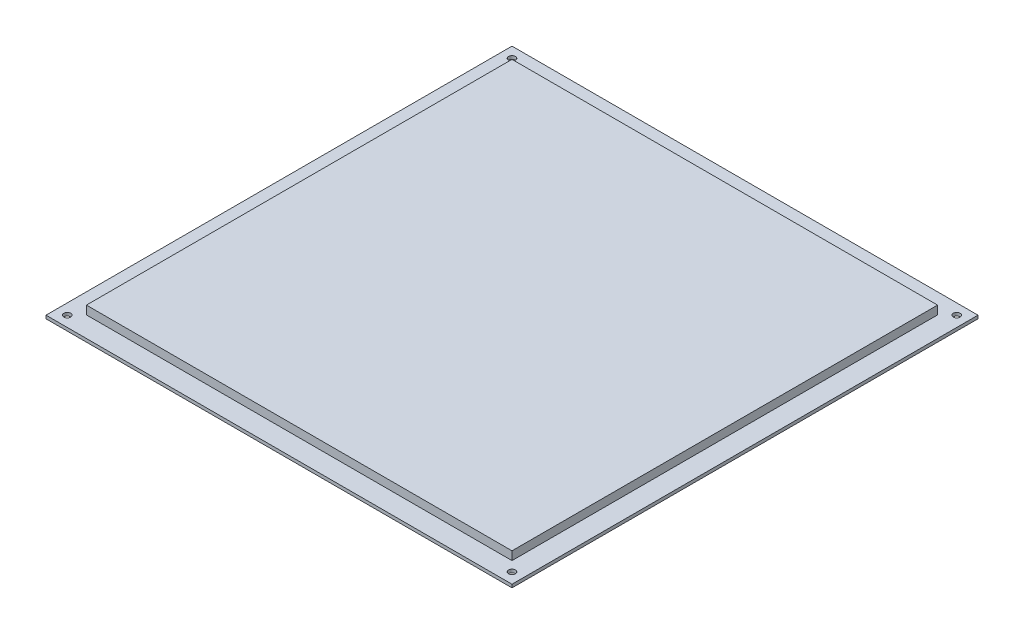
ISO-10303-21;
HEADER;
FILE_DESCRIPTION(('STEP AP214'),'2;1');
FILE_NAME('part.step','',(''),(''),'','','');
FILE_SCHEMA(('AUTOMOTIVE_DESIGN { 1 0 10303 214 1 1 1 1 }'));
ENDSEC;
DATA;
#1=APPLICATION_CONTEXT('core data for automotive mechanical design processes');
#2=APPLICATION_PROTOCOL_DEFINITION('international standard','automotive_design',2000,#1);
#3=PRODUCT_CONTEXT('',#1,'mechanical');
#4=PRODUCT('Part','Part','',(#3));
#5=PRODUCT_RELATED_PRODUCT_CATEGORY('part','',(#4));
#6=PRODUCT_DEFINITION_FORMATION('','',#4);
#7=PRODUCT_DEFINITION_CONTEXT('part definition',#1,'design');
#8=PRODUCT_DEFINITION('design','',#6,#7);
#9=PRODUCT_DEFINITION_SHAPE('','',#8);
#10=(LENGTH_UNIT() NAMED_UNIT(*) SI_UNIT(.MILLI.,.METRE.));
#11=(NAMED_UNIT(*) PLANE_ANGLE_UNIT() SI_UNIT($,.RADIAN.));
#12=(NAMED_UNIT(*) SI_UNIT($,.STERADIAN.) SOLID_ANGLE_UNIT());
#13=UNCERTAINTY_MEASURE_WITH_UNIT(LENGTH_MEASURE(1.E-05),#10,'distance_accuracy_value','');
#14=(GEOMETRIC_REPRESENTATION_CONTEXT(3) GLOBAL_UNCERTAINTY_ASSIGNED_CONTEXT((#13)) GLOBAL_UNIT_ASSIGNED_CONTEXT((#10,
#11,#12)) REPRESENTATION_CONTEXT('',''));
#15=CARTESIAN_POINT('',(0.,0.,0.));
#16=DIRECTION('',(0.,0.,1.));
#17=DIRECTION('',(1.,0.,0.));
#18=AXIS2_PLACEMENT_3D('',#15,#16,#17);
#19=CARTESIAN_POINT('',(100.,5.6,-100.));
#20=DIRECTION('',(-1.,0.,0.));
#21=DIRECTION('',(0.,0.,1.));
#22=AXIS2_PLACEMENT_3D('',#19,#20,#21);
#23=PLANE('',#22);
#24=DIRECTION('',(0.,0.,-1.));
#25=VECTOR('',#24,1.);
#26=CARTESIAN_POINT('',(100.,1.6,-100.));
#27=LINE('',#26,#25);
#28=CARTESIAN_POINT('',(100.,1.6,100.));
#29=VERTEX_POINT('',#28);
#30=CARTESIAN_POINT('',(100.,1.6,-100.));
#31=VERTEX_POINT('',#30);
#32=EDGE_CURVE('E108',#29,#31,#27,.T.);
#33=ORIENTED_EDGE('',*,*,#32,.T.);
#34=DIRECTION('',(0.,-1.,0.));
#35=VECTOR('',#34,1.);
#36=CARTESIAN_POINT('',(100.,5.6,-100.));
#37=LINE('',#36,#35);
#38=CARTESIAN_POINT('',(100.,5.6,-100.));
#39=VERTEX_POINT('',#38);
#40=EDGE_CURVE('E12',#39,#31,#37,.T.);
#41=ORIENTED_EDGE('',*,*,#40,.F.);
#42=DIRECTION('',(0.,0.,-1.));
#43=VECTOR('',#42,1.);
#44=CARTESIAN_POINT('',(100.,5.6,-100.));
#45=LINE('',#44,#43);
#46=CARTESIAN_POINT('',(100.,5.6,100.));
#47=VERTEX_POINT('',#46);
#48=EDGE_CURVE('E96',#47,#39,#45,.T.);
#49=ORIENTED_EDGE('',*,*,#48,.F.);
#50=DIRECTION('',(0.,-1.,0.));
#51=VECTOR('',#50,1.);
#52=CARTESIAN_POINT('',(100.,5.6,100.));
#53=LINE('',#52,#51);
#54=EDGE_CURVE('E104',#47,#29,#53,.T.);
#55=ORIENTED_EDGE('',*,*,#54,.T.);
#56=EDGE_LOOP('',(#33,#41,#49,#55));
#57=FACE_BOUND('',#56,.T.);
#58=ADVANCED_FACE('F45',(#57),#23,.F.);
#59=CARTESIAN_POINT('',(-100.,5.6,-100.));
#60=DIRECTION('',(0.,0.,1.));
#61=DIRECTION('',(1.,0.,0.));
#62=AXIS2_PLACEMENT_3D('',#59,#60,#61);
#63=PLANE('',#62);
#64=DIRECTION('',(-1.,0.,0.));
#65=VECTOR('',#64,1.);
#66=CARTESIAN_POINT('',(-100.,1.6,-100.));
#67=LINE('',#66,#65);
#68=CARTESIAN_POINT('',(-100.,1.6,-100.));
#69=VERTEX_POINT('',#68);
#70=EDGE_CURVE('E100',#31,#69,#67,.T.);
#71=ORIENTED_EDGE('',*,*,#70,.T.);
#72=DIRECTION('',(0.,-1.,0.));
#73=VECTOR('',#72,1.);
#74=CARTESIAN_POINT('',(-100.,5.6,-100.));
#75=LINE('',#74,#73);
#76=CARTESIAN_POINT('',(-100.,5.6,-100.));
#77=VERTEX_POINT('',#76);
#78=EDGE_CURVE('E53',#77,#69,#75,.T.);
#79=ORIENTED_EDGE('',*,*,#78,.F.);
#80=DIRECTION('',(-1.,0.,0.));
#81=VECTOR('',#80,1.);
#82=CARTESIAN_POINT('',(-100.,5.6,-100.));
#83=LINE('',#82,#81);
#84=EDGE_CURVE('E91',#39,#77,#83,.T.);
#85=ORIENTED_EDGE('',*,*,#84,.F.);
#86=ORIENTED_EDGE('',*,*,#40,.T.);
#87=EDGE_LOOP('',(#71,#79,#85,#86));
#88=FACE_BOUND('',#87,.T.);
#89=ADVANCED_FACE('F99',(#88),#63,.F.);
#90=CARTESIAN_POINT('',(-100.,5.6,-100.));
#91=DIRECTION('',(1.,0.,0.));
#92=DIRECTION('',(0.,0.,-1.));
#93=AXIS2_PLACEMENT_3D('',#90,#91,#92);
#94=PLANE('',#93);
#95=DIRECTION('',(0.,0.,1.));
#96=VECTOR('',#95,1.);
#97=CARTESIAN_POINT('',(-100.,1.6,-100.));
#98=LINE('',#97,#96);
#99=CARTESIAN_POINT('',(-100.,1.6,100.));
#100=VERTEX_POINT('',#99);
#101=EDGE_CURVE('E78',#69,#100,#98,.T.);
#102=ORIENTED_EDGE('',*,*,#101,.T.);
#103=DIRECTION('',(0.,-1.,0.));
#104=VECTOR('',#103,1.);
#105=CARTESIAN_POINT('',(-100.,5.6,100.));
#106=LINE('',#105,#104);
#107=CARTESIAN_POINT('',(-100.,5.6,100.));
#108=VERTEX_POINT('',#107);
#109=EDGE_CURVE('E101',#108,#100,#106,.T.);
#110=ORIENTED_EDGE('',*,*,#109,.F.);
#111=DIRECTION('',(0.,0.,1.));
#112=VECTOR('',#111,1.);
#113=CARTESIAN_POINT('',(-100.,5.6,-100.));
#114=LINE('',#113,#112);
#115=EDGE_CURVE('E94',#77,#108,#114,.T.);
#116=ORIENTED_EDGE('',*,*,#115,.F.);
#117=ORIENTED_EDGE('',*,*,#78,.T.);
#118=EDGE_LOOP('',(#102,#110,#116,#117));
#119=FACE_BOUND('',#118,.T.);
#120=ADVANCED_FACE('F102',(#119),#94,.F.);
#121=CARTESIAN_POINT('',(-100.,5.6,100.));
#122=DIRECTION('',(0.,0.,-1.));
#123=DIRECTION('',(-1.,0.,0.));
#124=AXIS2_PLACEMENT_3D('',#121,#122,#123);
#125=PLANE('',#124);
#126=DIRECTION('',(1.,0.,0.));
#127=VECTOR('',#126,1.);
#128=CARTESIAN_POINT('',(-100.,1.6,100.));
#129=LINE('',#128,#127);
#130=EDGE_CURVE('E84',#100,#29,#129,.T.);
#131=ORIENTED_EDGE('',*,*,#130,.T.);
#132=ORIENTED_EDGE('',*,*,#54,.F.);
#133=DIRECTION('',(1.,0.,0.));
#134=VECTOR('',#133,1.);
#135=CARTESIAN_POINT('',(-100.,5.6,100.));
#136=LINE('',#135,#134);
#137=EDGE_CURVE('E61',#108,#47,#136,.T.);
#138=ORIENTED_EDGE('',*,*,#137,.F.);
#139=ORIENTED_EDGE('',*,*,#109,.T.);
#140=EDGE_LOOP('',(#131,#132,#138,#139));
#141=FACE_BOUND('',#140,.T.);
#142=ADVANCED_FACE('F115',(#141),#125,.F.);
#143=CARTESIAN_POINT('',(0.,5.6,0.));
#144=DIRECTION('',(0.,1.,0.));
#145=DIRECTION('',(0.,0.,1.));
#146=AXIS2_PLACEMENT_3D('',#143,#144,#145);
#147=PLANE('',#146);
#148=ORIENTED_EDGE('',*,*,#48,.T.);
#149=ORIENTED_EDGE('',*,*,#84,.T.);
#150=ORIENTED_EDGE('',*,*,#115,.T.);
#151=ORIENTED_EDGE('',*,*,#137,.T.);
#152=EDGE_LOOP('',(#148,#149,#150,#151));
#153=FACE_BOUND('',#152,.T.);
#154=ADVANCED_FACE('F92',(#153),#147,.T.);
#155=CARTESIAN_POINT('',(0.,1.6,0.));
#156=DIRECTION('',(0.,1.,0.));
#157=DIRECTION('',(0.,0.,1.));
#158=AXIS2_PLACEMENT_3D('',#155,#156,#157);
#159=PLANE('',#158);
#160=ORIENTED_EDGE('',*,*,#32,.F.);
#161=ORIENTED_EDGE('',*,*,#130,.F.);
#162=ORIENTED_EDGE('',*,*,#101,.F.);
#163=ORIENTED_EDGE('',*,*,#70,.F.);
#164=EDGE_LOOP('',(#160,#161,#162,#163));
#165=FACE_BOUND('',#164,.T.);
#166=ADVANCED_FACE('F118',(#165),#159,.F.);
#167=CLOSED_SHELL('',(#58,#89,#120,#142,#154,#166));
#168=MANIFOLD_SOLID_BREP('B2',#167);
#169=CARTESIAN_POINT('',(109.5,1.5,-109.5));
#170=DIRECTION('',(-1.,0.,0.));
#171=DIRECTION('',(0.,0.,1.));
#172=AXIS2_PLACEMENT_3D('',#169,#170,#171);
#173=PLANE('',#172);
#174=DIRECTION('',(0.,0.,-1.));
#175=VECTOR('',#174,1.);
#176=CARTESIAN_POINT('',(109.5,0.,-109.5));
#177=LINE('',#176,#175);
#178=CARTESIAN_POINT('',(109.5,0.,109.5));
#179=VERTEX_POINT('',#178);
#180=CARTESIAN_POINT('',(109.5,0.,-109.5));
#181=VERTEX_POINT('',#180);
#182=EDGE_CURVE('E231',#179,#181,#177,.T.);
#183=ORIENTED_EDGE('',*,*,#182,.T.);
#184=DIRECTION('',(0.,-1.,0.));
#185=VECTOR('',#184,1.);
#186=CARTESIAN_POINT('',(109.5,1.5,-109.5));
#187=LINE('',#186,#185);
#188=CARTESIAN_POINT('',(109.5,1.5,-109.5));
#189=VERTEX_POINT('',#188);
#190=EDGE_CURVE('E43',#189,#181,#187,.T.);
#191=ORIENTED_EDGE('',*,*,#190,.F.);
#192=DIRECTION('',(0.,0.,-1.));
#193=VECTOR('',#192,1.);
#194=CARTESIAN_POINT('',(109.5,1.5,-109.5));
#195=LINE('',#194,#193);
#196=CARTESIAN_POINT('',(109.5,1.5,109.5));
#197=VERTEX_POINT('',#196);
#198=EDGE_CURVE('E219',#197,#189,#195,.T.);
#199=ORIENTED_EDGE('',*,*,#198,.F.);
#200=DIRECTION('',(0.,-1.,0.));
#201=VECTOR('',#200,1.);
#202=CARTESIAN_POINT('',(109.5,1.5,109.5));
#203=LINE('',#202,#201);
#204=EDGE_CURVE('E227',#197,#179,#203,.T.);
#205=ORIENTED_EDGE('',*,*,#204,.T.);
#206=EDGE_LOOP('',(#183,#191,#199,#205));
#207=FACE_BOUND('',#206,.T.);
#208=ADVANCED_FACE('F168',(#207),#173,.F.);
#209=CARTESIAN_POINT('',(-109.5,1.5,-109.5));
#210=DIRECTION('',(0.,0.,1.));
#211=DIRECTION('',(1.,0.,0.));
#212=AXIS2_PLACEMENT_3D('',#209,#210,#211);
#213=PLANE('',#212);
#214=DIRECTION('',(-1.,0.,0.));
#215=VECTOR('',#214,1.);
#216=CARTESIAN_POINT('',(-109.5,0.,-109.5));
#217=LINE('',#216,#215);
#218=CARTESIAN_POINT('',(-109.5,0.,-109.5));
#219=VERTEX_POINT('',#218);
#220=EDGE_CURVE('E223',#181,#219,#217,.T.);
#221=ORIENTED_EDGE('',*,*,#220,.T.);
#222=DIRECTION('',(0.,-1.,0.));
#223=VECTOR('',#222,1.);
#224=CARTESIAN_POINT('',(-109.5,1.5,-109.5));
#225=LINE('',#224,#223);
#226=CARTESIAN_POINT('',(-109.5,1.5,-109.5));
#227=VERTEX_POINT('',#226);
#228=EDGE_CURVE('E176',#227,#219,#225,.T.);
#229=ORIENTED_EDGE('',*,*,#228,.F.);
#230=DIRECTION('',(-1.,0.,0.));
#231=VECTOR('',#230,1.);
#232=CARTESIAN_POINT('',(-109.5,1.5,-109.5));
#233=LINE('',#232,#231);
#234=EDGE_CURVE('E214',#189,#227,#233,.T.);
#235=ORIENTED_EDGE('',*,*,#234,.F.);
#236=ORIENTED_EDGE('',*,*,#190,.T.);
#237=EDGE_LOOP('',(#221,#229,#235,#236));
#238=FACE_BOUND('',#237,.T.);
#239=ADVANCED_FACE('F222',(#238),#213,.F.);
#240=CARTESIAN_POINT('',(-109.5,1.5,-109.5));
#241=DIRECTION('',(1.,0.,0.));
#242=DIRECTION('',(0.,0.,-1.));
#243=AXIS2_PLACEMENT_3D('',#240,#241,#242);
#244=PLANE('',#243);
#245=DIRECTION('',(0.,0.,1.));
#246=VECTOR('',#245,1.);
#247=CARTESIAN_POINT('',(-109.5,0.,-109.5));
#248=LINE('',#247,#246);
#249=CARTESIAN_POINT('',(-109.5,0.,109.5));
#250=VERTEX_POINT('',#249);
#251=EDGE_CURVE('E201',#219,#250,#248,.T.);
#252=ORIENTED_EDGE('',*,*,#251,.T.);
#253=DIRECTION('',(0.,-1.,0.));
#254=VECTOR('',#253,1.);
#255=CARTESIAN_POINT('',(-109.5,1.5,109.5));
#256=LINE('',#255,#254);
#257=CARTESIAN_POINT('',(-109.5,1.5,109.5));
#258=VERTEX_POINT('',#257);
#259=EDGE_CURVE('E224',#258,#250,#256,.T.);
#260=ORIENTED_EDGE('',*,*,#259,.F.);
#261=DIRECTION('',(0.,0.,1.));
#262=VECTOR('',#261,1.);
#263=CARTESIAN_POINT('',(-109.5,1.5,-109.5));
#264=LINE('',#263,#262);
#265=EDGE_CURVE('E217',#227,#258,#264,.T.);
#266=ORIENTED_EDGE('',*,*,#265,.F.);
#267=ORIENTED_EDGE('',*,*,#228,.T.);
#268=EDGE_LOOP('',(#252,#260,#266,#267));
#269=FACE_BOUND('',#268,.T.);
#270=ADVANCED_FACE('F225',(#269),#244,.F.);
#271=CARTESIAN_POINT('',(-109.5,1.5,109.5));
#272=DIRECTION('',(0.,0.,-1.));
#273=DIRECTION('',(-1.,0.,0.));
#274=AXIS2_PLACEMENT_3D('',#271,#272,#273);
#275=PLANE('',#274);
#276=DIRECTION('',(1.,0.,0.));
#277=VECTOR('',#276,1.);
#278=CARTESIAN_POINT('',(-109.5,0.,109.5));
#279=LINE('',#278,#277);
#280=EDGE_CURVE('E207',#250,#179,#279,.T.);
#281=ORIENTED_EDGE('',*,*,#280,.T.);
#282=ORIENTED_EDGE('',*,*,#204,.F.);
#283=DIRECTION('',(1.,0.,0.));
#284=VECTOR('',#283,1.);
#285=CARTESIAN_POINT('',(-109.5,1.5,109.5));
#286=LINE('',#285,#284);
#287=EDGE_CURVE('E184',#258,#197,#286,.T.);
#288=ORIENTED_EDGE('',*,*,#287,.F.);
#289=ORIENTED_EDGE('',*,*,#259,.T.);
#290=EDGE_LOOP('',(#281,#282,#288,#289));
#291=FACE_BOUND('',#290,.T.);
#292=ADVANCED_FACE('F239',(#291),#275,.F.);
#293=CARTESIAN_POINT('',(0.,1.5,0.));
#294=DIRECTION('',(0.,1.,0.));
#295=DIRECTION('',(0.,0.,1.));
#296=AXIS2_PLACEMENT_3D('',#293,#294,#295);
#297=PLANE('',#296);
#298=CARTESIAN_POINT('',(-104.5,1.5,-104.5));
#299=DIRECTION('',(0.,1.,0.));
#300=DIRECTION('',(0.,0.,1.));
#301=AXIS2_PLACEMENT_3D('',#298,#299,#300);
#302=CIRCLE('',#301,1.6);
#303=CARTESIAN_POINT('',(-104.5,1.5,-102.9));
#304=VERTEX_POINT('',#303);
#305=EDGE_CURVE('E265',#304,#304,#302,.T.);
#306=ORIENTED_EDGE('',*,*,#305,.F.);
#307=EDGE_LOOP('',(#306));
#308=FACE_BOUND('',#307,.T.);
#309=CARTESIAN_POINT('',(104.5,1.5,-104.5));
#310=DIRECTION('',(0.,1.,0.));
#311=DIRECTION('',(0.,0.,1.));
#312=AXIS2_PLACEMENT_3D('',#309,#310,#311);
#313=CIRCLE('',#312,1.6);
#314=CARTESIAN_POINT('',(104.5,1.5,-102.9));
#315=VERTEX_POINT('',#314);
#316=EDGE_CURVE('E259',#315,#315,#313,.T.);
#317=ORIENTED_EDGE('',*,*,#316,.F.);
#318=EDGE_LOOP('',(#317));
#319=FACE_BOUND('',#318,.T.);
#320=CARTESIAN_POINT('',(104.5,1.5,104.5));
#321=DIRECTION('',(0.,1.,0.));
#322=DIRECTION('',(0.,0.,1.));
#323=AXIS2_PLACEMENT_3D('',#320,#321,#322);
#324=CIRCLE('',#323,1.6);
#325=CARTESIAN_POINT('',(104.5,1.5,106.1));
#326=VERTEX_POINT('',#325);
#327=EDGE_CURVE('E253',#326,#326,#324,.T.);
#328=ORIENTED_EDGE('',*,*,#327,.F.);
#329=EDGE_LOOP('',(#328));
#330=FACE_BOUND('',#329,.T.);
#331=CARTESIAN_POINT('',(-104.5,1.5,104.5));
#332=DIRECTION('',(0.,1.,0.));
#333=DIRECTION('',(0.,0.,1.));
#334=AXIS2_PLACEMENT_3D('',#331,#332,#333);
#335=CIRCLE('',#334,1.6);
#336=CARTESIAN_POINT('',(-104.5,1.5,106.1));
#337=VERTEX_POINT('',#336);
#338=EDGE_CURVE('E247',#337,#337,#335,.T.);
#339=ORIENTED_EDGE('',*,*,#338,.F.);
#340=EDGE_LOOP('',(#339));
#341=FACE_BOUND('',#340,.T.);
#342=ORIENTED_EDGE('',*,*,#198,.T.);
#343=ORIENTED_EDGE('',*,*,#234,.T.);
#344=ORIENTED_EDGE('',*,*,#265,.T.);
#345=ORIENTED_EDGE('',*,*,#287,.T.);
#346=EDGE_LOOP('',(#342,#343,#344,#345));
#347=FACE_BOUND('',#346,.T.);
#348=ADVANCED_FACE('F215',(#308,#319,#330,#341,#347),#297,.T.);
#349=CARTESIAN_POINT('',(0.,0.,0.));
#350=DIRECTION('',(0.,1.,0.));
#351=DIRECTION('',(0.,0.,1.));
#352=AXIS2_PLACEMENT_3D('',#349,#350,#351);
#353=PLANE('',#352);
#354=CARTESIAN_POINT('',(-104.5,0.,-104.5));
#355=DIRECTION('',(0.,1.,0.));
#356=DIRECTION('',(0.,0.,1.));
#357=AXIS2_PLACEMENT_3D('',#354,#355,#356);
#358=CIRCLE('',#357,1.6);
#359=CARTESIAN_POINT('',(-104.5,0.,-102.9));
#360=VERTEX_POINT('',#359);
#361=EDGE_CURVE('E262',#360,#360,#358,.T.);
#362=ORIENTED_EDGE('',*,*,#361,.T.);
#363=EDGE_LOOP('',(#362));
#364=FACE_BOUND('',#363,.T.);
#365=CARTESIAN_POINT('',(104.5,0.,-104.5));
#366=DIRECTION('',(0.,1.,0.));
#367=DIRECTION('',(0.,0.,1.));
#368=AXIS2_PLACEMENT_3D('',#365,#366,#367);
#369=CIRCLE('',#368,1.6);
#370=CARTESIAN_POINT('',(104.5,0.,-102.9));
#371=VERTEX_POINT('',#370);
#372=EDGE_CURVE('E256',#371,#371,#369,.T.);
#373=ORIENTED_EDGE('',*,*,#372,.T.);
#374=EDGE_LOOP('',(#373));
#375=FACE_BOUND('',#374,.T.);
#376=CARTESIAN_POINT('',(104.5,0.,104.5));
#377=DIRECTION('',(0.,1.,0.));
#378=DIRECTION('',(0.,0.,1.));
#379=AXIS2_PLACEMENT_3D('',#376,#377,#378);
#380=CIRCLE('',#379,1.6);
#381=CARTESIAN_POINT('',(104.5,0.,106.1));
#382=VERTEX_POINT('',#381);
#383=EDGE_CURVE('E250',#382,#382,#380,.T.);
#384=ORIENTED_EDGE('',*,*,#383,.T.);
#385=EDGE_LOOP('',(#384));
#386=FACE_BOUND('',#385,.T.);
#387=CARTESIAN_POINT('',(-104.5,0.,104.5));
#388=DIRECTION('',(0.,1.,0.));
#389=DIRECTION('',(0.,0.,1.));
#390=AXIS2_PLACEMENT_3D('',#387,#388,#389);
#391=CIRCLE('',#390,1.6);
#392=CARTESIAN_POINT('',(-104.5,0.,106.1));
#393=VERTEX_POINT('',#392);
#394=EDGE_CURVE('E234',#393,#393,#391,.T.);
#395=ORIENTED_EDGE('',*,*,#394,.T.);
#396=EDGE_LOOP('',(#395));
#397=FACE_BOUND('',#396,.T.);
#398=ORIENTED_EDGE('',*,*,#182,.F.);
#399=ORIENTED_EDGE('',*,*,#280,.F.);
#400=ORIENTED_EDGE('',*,*,#251,.F.);
#401=ORIENTED_EDGE('',*,*,#220,.F.);
#402=EDGE_LOOP('',(#398,#399,#400,#401));
#403=FACE_BOUND('',#402,.T.);
#404=ADVANCED_FACE('F242',(#364,#375,#386,#397,#403),#353,.F.);
#405=CARTESIAN_POINT('',(-104.5,1.5,104.5));
#406=DIRECTION('',(0.,1.,0.));
#407=DIRECTION('',(0.,0.,1.));
#408=AXIS2_PLACEMENT_3D('',#405,#406,#407);
#409=CYLINDRICAL_SURFACE('',#408,1.6);
#410=ORIENTED_EDGE('',*,*,#394,.F.);
#411=EDGE_LOOP('',(#410));
#412=FACE_BOUND('',#411,.T.);
#413=ORIENTED_EDGE('',*,*,#338,.T.);
#414=EDGE_LOOP('',(#413));
#415=FACE_BOUND('',#414,.T.);
#416=ADVANCED_FACE('F280',(#412,#415),#409,.F.);
#417=CARTESIAN_POINT('',(104.5,1.5,104.5));
#418=DIRECTION('',(0.,1.,0.));
#419=DIRECTION('',(0.,0.,1.));
#420=AXIS2_PLACEMENT_3D('',#417,#418,#419);
#421=CYLINDRICAL_SURFACE('',#420,1.6);
#422=ORIENTED_EDGE('',*,*,#383,.F.);
#423=EDGE_LOOP('',(#422));
#424=FACE_BOUND('',#423,.T.);
#425=ORIENTED_EDGE('',*,*,#327,.T.);
#426=EDGE_LOOP('',(#425));
#427=FACE_BOUND('',#426,.T.);
#428=ADVANCED_FACE('F282',(#424,#427),#421,.F.);
#429=CARTESIAN_POINT('',(104.5,1.5,-104.5));
#430=DIRECTION('',(0.,1.,0.));
#431=DIRECTION('',(0.,0.,1.));
#432=AXIS2_PLACEMENT_3D('',#429,#430,#431);
#433=CYLINDRICAL_SURFACE('',#432,1.6);
#434=ORIENTED_EDGE('',*,*,#372,.F.);
#435=EDGE_LOOP('',(#434));
#436=FACE_BOUND('',#435,.T.);
#437=ORIENTED_EDGE('',*,*,#316,.T.);
#438=EDGE_LOOP('',(#437));
#439=FACE_BOUND('',#438,.T.);
#440=ADVANCED_FACE('F289',(#436,#439),#433,.F.);
#441=CARTESIAN_POINT('',(-104.5,1.5,-104.5));
#442=DIRECTION('',(0.,1.,0.));
#443=DIRECTION('',(0.,0.,1.));
#444=AXIS2_PLACEMENT_3D('',#441,#442,#443);
#445=CYLINDRICAL_SURFACE('',#444,1.6);
#446=ORIENTED_EDGE('',*,*,#361,.F.);
#447=EDGE_LOOP('',(#446));
#448=FACE_BOUND('',#447,.T.);
#449=ORIENTED_EDGE('',*,*,#305,.T.);
#450=EDGE_LOOP('',(#449));
#451=FACE_BOUND('',#450,.T.);
#452=ADVANCED_FACE('F269',(#448,#451),#445,.F.);
#453=CLOSED_SHELL('',(#208,#239,#270,#292,#348,#404,#416,#428,#440,#452));
#454=MANIFOLD_SOLID_BREP('B6',#453);
#455=ADVANCED_BREP_SHAPE_REPRESENTATION('',(#18,#168,#454),#14);
#456=SHAPE_DEFINITION_REPRESENTATION(#9,#455);
ENDSEC;
END-ISO-10303-21;
